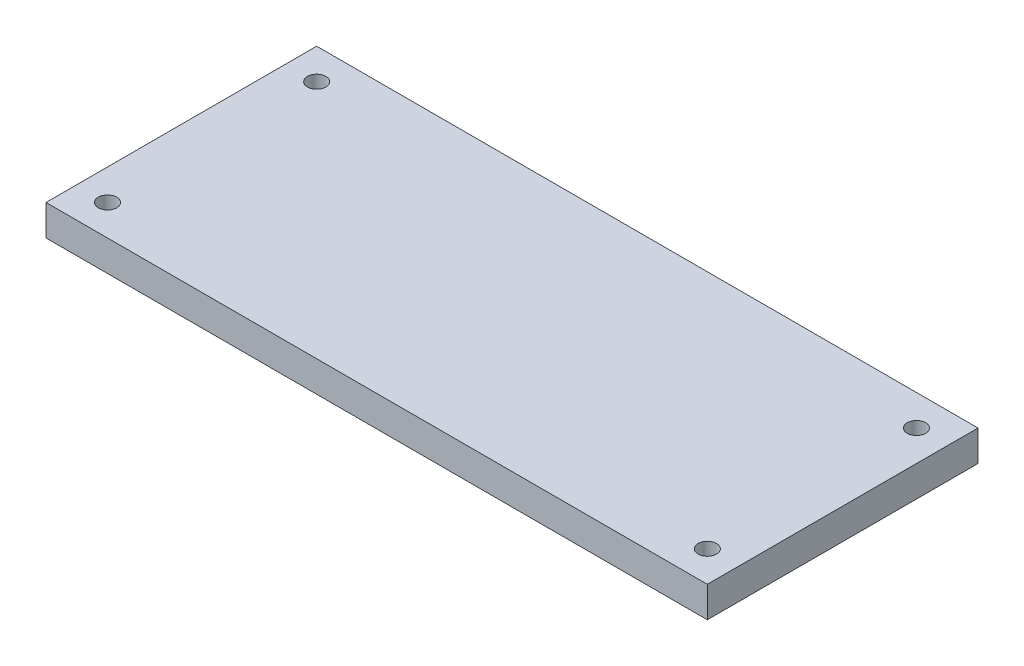
ISO-10303-21;
HEADER;
FILE_DESCRIPTION(('STEP AP214'),'2;1');
FILE_NAME('part.step','',(''),(''),'','','');
FILE_SCHEMA(('AUTOMOTIVE_DESIGN { 1 0 10303 214 1 1 1 1 }'));
ENDSEC;
DATA;
#1=APPLICATION_CONTEXT('core data for automotive mechanical design processes');
#2=APPLICATION_PROTOCOL_DEFINITION('international standard','automotive_design',2000,#1);
#3=PRODUCT_CONTEXT('',#1,'mechanical');
#4=PRODUCT('Part','Part','',(#3));
#5=PRODUCT_RELATED_PRODUCT_CATEGORY('part','',(#4));
#6=PRODUCT_DEFINITION_FORMATION('','',#4);
#7=PRODUCT_DEFINITION_CONTEXT('part definition',#1,'design');
#8=PRODUCT_DEFINITION('design','',#6,#7);
#9=PRODUCT_DEFINITION_SHAPE('','',#8);
#10=(LENGTH_UNIT() NAMED_UNIT(*) SI_UNIT(.MILLI.,.METRE.));
#11=(NAMED_UNIT(*) PLANE_ANGLE_UNIT() SI_UNIT($,.RADIAN.));
#12=(NAMED_UNIT(*) SI_UNIT($,.STERADIAN.) SOLID_ANGLE_UNIT());
#13=UNCERTAINTY_MEASURE_WITH_UNIT(LENGTH_MEASURE(1.E-05),#10,'distance_accuracy_value','');
#14=(GEOMETRIC_REPRESENTATION_CONTEXT(3) GLOBAL_UNCERTAINTY_ASSIGNED_CONTEXT((#13)) GLOBAL_UNIT_ASSIGNED_CONTEXT((#10,
#11,#12)) REPRESENTATION_CONTEXT('',''));
#15=CARTESIAN_POINT('',(0.,0.,0.));
#16=DIRECTION('',(0.,0.,1.));
#17=DIRECTION('',(1.,0.,0.));
#18=AXIS2_PLACEMENT_3D('',#15,#16,#17);
#19=CARTESIAN_POINT('',(0.,10.,0.));
#20=DIRECTION('',(0.,1.,0.));
#21=DIRECTION('',(0.,0.,1.));
#22=AXIS2_PLACEMENT_3D('',#19,#20,#21);
#23=PLANE('',#22);
#24=CARTESIAN_POINT('',(205.,10.,-78.));
#25=DIRECTION('',(0.,1.,0.));
#26=DIRECTION('',(0.,0.,1.));
#27=AXIS2_PLACEMENT_3D('',#24,#25,#26);
#28=CIRCLE('',#27,2.99999999999999);
#29=CARTESIAN_POINT('',(205.,10.,-75.));
#30=VERTEX_POINT('',#29);
#31=EDGE_CURVE('E142',#30,#30,#28,.T.);
#32=ORIENTED_EDGE('',*,*,#31,.F.);
#33=EDGE_LOOP('',(#32));
#34=FACE_BOUND('',#33,.T.);
#35=CARTESIAN_POINT('',(10.,10.,-10.));
#36=DIRECTION('',(0.,1.,0.));
#37=DIRECTION('',(0.,0.,1.));
#38=AXIS2_PLACEMENT_3D('',#35,#36,#37);
#39=CIRCLE('',#38,3.);
#40=CARTESIAN_POINT('',(10.,10.,-7.));
#41=VERTEX_POINT('',#40);
#42=EDGE_CURVE('E112',#41,#41,#39,.T.);
#43=ORIENTED_EDGE('',*,*,#42,.F.);
#44=EDGE_LOOP('',(#43));
#45=FACE_BOUND('',#44,.T.);
#46=DIRECTION('',(0.,0.,1.));
#47=VECTOR('',#46,1.);
#48=CARTESIAN_POINT('',(0.,10.,-88.));
#49=LINE('',#48,#47);
#50=CARTESIAN_POINT('',(0.,10.,-88.));
#51=VERTEX_POINT('',#50);
#52=CARTESIAN_POINT('',(0.,10.,0.));
#53=VERTEX_POINT('',#52);
#54=EDGE_CURVE('E92',#51,#53,#49,.T.);
#55=ORIENTED_EDGE('',*,*,#54,.T.);
#56=DIRECTION('',(1.,0.,0.));
#57=VECTOR('',#56,1.);
#58=CARTESIAN_POINT('',(0.,10.,0.));
#59=LINE('',#58,#57);
#60=CARTESIAN_POINT('',(215.,10.,0.));
#61=VERTEX_POINT('',#60);
#62=EDGE_CURVE('E87',#53,#61,#59,.T.);
#63=ORIENTED_EDGE('',*,*,#62,.T.);
#64=DIRECTION('',(0.,0.,-1.));
#65=VECTOR('',#64,1.);
#66=CARTESIAN_POINT('',(215.,10.,-88.));
#67=LINE('',#66,#65);
#68=CARTESIAN_POINT('',(215.,10.,-88.));
#69=VERTEX_POINT('',#68);
#70=EDGE_CURVE('E90',#61,#69,#67,.T.);
#71=ORIENTED_EDGE('',*,*,#70,.T.);
#72=DIRECTION('',(-1.,0.,0.));
#73=VECTOR('',#72,1.);
#74=CARTESIAN_POINT('',(0.,10.,-88.));
#75=LINE('',#74,#73);
#76=EDGE_CURVE('E57',#69,#51,#75,.T.);
#77=ORIENTED_EDGE('',*,*,#76,.T.);
#78=EDGE_LOOP('',(#55,#63,#71,#77));
#79=FACE_BOUND('',#78,.T.);
#80=CARTESIAN_POINT('',(10.,10.,-78.));
#81=DIRECTION('',(0.,1.,0.));
#82=DIRECTION('',(0.,0.,1.));
#83=AXIS2_PLACEMENT_3D('',#80,#81,#82);
#84=CIRCLE('',#83,3.);
#85=CARTESIAN_POINT('',(10.,10.,-75.));
#86=VERTEX_POINT('',#85);
#87=EDGE_CURVE('E134',#86,#86,#84,.T.);
#88=ORIENTED_EDGE('',*,*,#87,.F.);
#89=EDGE_LOOP('',(#88));
#90=FACE_BOUND('',#89,.T.);
#91=CARTESIAN_POINT('',(205.,10.,-10.));
#92=DIRECTION('',(0.,1.,0.));
#93=DIRECTION('',(0.,0.,1.));
#94=AXIS2_PLACEMENT_3D('',#91,#92,#93);
#95=CIRCLE('',#94,2.99999999999999);
#96=CARTESIAN_POINT('',(205.,10.,-7.00000000000001));
#97=VERTEX_POINT('',#96);
#98=EDGE_CURVE('E150',#97,#97,#95,.T.);
#99=ORIENTED_EDGE('',*,*,#98,.F.);
#100=EDGE_LOOP('',(#99));
#101=FACE_BOUND('',#100,.T.);
#102=ADVANCED_FACE('F39',(#34,#45,#79,#90,#101),#23,.T.);
#103=CARTESIAN_POINT('',(0.,0.,0.));
#104=DIRECTION('',(0.,1.,0.));
#105=DIRECTION('',(0.,0.,1.));
#106=AXIS2_PLACEMENT_3D('',#103,#104,#105);
#107=PLANE('',#106);
#108=DIRECTION('',(0.,0.,1.));
#109=VECTOR('',#108,1.);
#110=CARTESIAN_POINT('',(0.,0.,-88.));
#111=LINE('',#110,#109);
#112=CARTESIAN_POINT('',(0.,0.,-88.));
#113=VERTEX_POINT('',#112);
#114=CARTESIAN_POINT('',(0.,0.,0.));
#115=VERTEX_POINT('',#114);
#116=EDGE_CURVE('E108',#113,#115,#111,.T.);
#117=ORIENTED_EDGE('',*,*,#116,.F.);
#118=DIRECTION('',(-1.,0.,0.));
#119=VECTOR('',#118,1.);
#120=CARTESIAN_POINT('',(0.,0.,-88.));
#121=LINE('',#120,#119);
#122=CARTESIAN_POINT('',(215.,0.,-88.));
#123=VERTEX_POINT('',#122);
#124=EDGE_CURVE('E80',#123,#113,#121,.T.);
#125=ORIENTED_EDGE('',*,*,#124,.F.);
#126=DIRECTION('',(0.,0.,-1.));
#127=VECTOR('',#126,1.);
#128=CARTESIAN_POINT('',(215.,0.,-88.));
#129=LINE('',#128,#127);
#130=CARTESIAN_POINT('',(215.,0.,0.));
#131=VERTEX_POINT('',#130);
#132=EDGE_CURVE('E74',#131,#123,#129,.T.);
#133=ORIENTED_EDGE('',*,*,#132,.F.);
#134=DIRECTION('',(1.,0.,0.));
#135=VECTOR('',#134,1.);
#136=CARTESIAN_POINT('',(0.,0.,0.));
#137=LINE('',#136,#135);
#138=EDGE_CURVE('E97',#115,#131,#137,.T.);
#139=ORIENTED_EDGE('',*,*,#138,.F.);
#140=EDGE_LOOP('',(#117,#125,#133,#139));
#141=FACE_BOUND('',#140,.T.);
#142=CARTESIAN_POINT('',(10.,0.,-10.));
#143=DIRECTION('',(0.,1.,0.));
#144=DIRECTION('',(0.,0.,1.));
#145=AXIS2_PLACEMENT_3D('',#142,#143,#144);
#146=CIRCLE('',#145,3.);
#147=CARTESIAN_POINT('',(10.,0.,-7.));
#148=VERTEX_POINT('',#147);
#149=EDGE_CURVE('E130',#148,#148,#146,.T.);
#150=ORIENTED_EDGE('',*,*,#149,.T.);
#151=EDGE_LOOP('',(#150));
#152=FACE_BOUND('',#151,.T.);
#153=CARTESIAN_POINT('',(10.,0.,-78.));
#154=DIRECTION('',(0.,1.,0.));
#155=DIRECTION('',(0.,0.,1.));
#156=AXIS2_PLACEMENT_3D('',#153,#154,#155);
#157=CIRCLE('',#156,3.);
#158=CARTESIAN_POINT('',(10.,0.,-75.));
#159=VERTEX_POINT('',#158);
#160=EDGE_CURVE('E138',#159,#159,#157,.T.);
#161=ORIENTED_EDGE('',*,*,#160,.T.);
#162=EDGE_LOOP('',(#161));
#163=FACE_BOUND('',#162,.T.);
#164=CARTESIAN_POINT('',(205.,0.,-78.));
#165=DIRECTION('',(0.,1.,0.));
#166=DIRECTION('',(0.,0.,1.));
#167=AXIS2_PLACEMENT_3D('',#164,#165,#166);
#168=CIRCLE('',#167,2.99999999999999);
#169=CARTESIAN_POINT('',(205.,0.,-75.));
#170=VERTEX_POINT('',#169);
#171=EDGE_CURVE('E146',#170,#170,#168,.T.);
#172=ORIENTED_EDGE('',*,*,#171,.T.);
#173=EDGE_LOOP('',(#172));
#174=FACE_BOUND('',#173,.T.);
#175=CARTESIAN_POINT('',(205.,0.,-10.));
#176=DIRECTION('',(0.,1.,0.));
#177=DIRECTION('',(0.,0.,1.));
#178=AXIS2_PLACEMENT_3D('',#175,#176,#177);
#179=CIRCLE('',#178,2.99999999999999);
#180=CARTESIAN_POINT('',(205.,0.,-7.00000000000001));
#181=VERTEX_POINT('',#180);
#182=EDGE_CURVE('E154',#181,#181,#179,.T.);
#183=ORIENTED_EDGE('',*,*,#182,.T.);
#184=EDGE_LOOP('',(#183));
#185=FACE_BOUND('',#184,.T.);
#186=ADVANCED_FACE('F125',(#141,#152,#163,#174,#185),#107,.F.);
#187=CARTESIAN_POINT('',(0.,10.,-88.));
#188=DIRECTION('',(1.,0.,0.));
#189=DIRECTION('',(0.,0.,-1.));
#190=AXIS2_PLACEMENT_3D('',#187,#188,#189);
#191=PLANE('',#190);
#192=ORIENTED_EDGE('',*,*,#116,.T.);
#193=DIRECTION('',(0.,-1.,0.));
#194=VECTOR('',#193,1.);
#195=CARTESIAN_POINT('',(0.,10.,0.));
#196=LINE('',#195,#194);
#197=EDGE_CURVE('E11',#53,#115,#196,.T.);
#198=ORIENTED_EDGE('',*,*,#197,.F.);
#199=ORIENTED_EDGE('',*,*,#54,.F.);
#200=DIRECTION('',(0.,-1.,0.));
#201=VECTOR('',#200,1.);
#202=CARTESIAN_POINT('',(0.,10.,-88.));
#203=LINE('',#202,#201);
#204=EDGE_CURVE('E104',#51,#113,#203,.T.);
#205=ORIENTED_EDGE('',*,*,#204,.T.);
#206=EDGE_LOOP('',(#192,#198,#199,#205));
#207=FACE_BOUND('',#206,.T.);
#208=ADVANCED_FACE('F41',(#207),#191,.F.);
#209=CARTESIAN_POINT('',(0.,10.,0.));
#210=DIRECTION('',(0.,0.,-1.));
#211=DIRECTION('',(-1.,0.,0.));
#212=AXIS2_PLACEMENT_3D('',#209,#210,#211);
#213=PLANE('',#212);
#214=ORIENTED_EDGE('',*,*,#138,.T.);
#215=DIRECTION('',(0.,-1.,0.));
#216=VECTOR('',#215,1.);
#217=CARTESIAN_POINT('',(215.,10.,0.));
#218=LINE('',#217,#216);
#219=EDGE_CURVE('E49',#61,#131,#218,.T.);
#220=ORIENTED_EDGE('',*,*,#219,.F.);
#221=ORIENTED_EDGE('',*,*,#62,.F.);
#222=ORIENTED_EDGE('',*,*,#197,.T.);
#223=EDGE_LOOP('',(#214,#220,#221,#222));
#224=FACE_BOUND('',#223,.T.);
#225=ADVANCED_FACE('F96',(#224),#213,.F.);
#226=CARTESIAN_POINT('',(215.,10.,-88.));
#227=DIRECTION('',(-1.,0.,0.));
#228=DIRECTION('',(0.,0.,1.));
#229=AXIS2_PLACEMENT_3D('',#226,#227,#228);
#230=PLANE('',#229);
#231=ORIENTED_EDGE('',*,*,#132,.T.);
#232=DIRECTION('',(0.,-1.,0.));
#233=VECTOR('',#232,1.);
#234=CARTESIAN_POINT('',(215.,10.,-88.));
#235=LINE('',#234,#233);
#236=EDGE_CURVE('E99',#69,#123,#235,.T.);
#237=ORIENTED_EDGE('',*,*,#236,.F.);
#238=ORIENTED_EDGE('',*,*,#70,.F.);
#239=ORIENTED_EDGE('',*,*,#219,.T.);
#240=EDGE_LOOP('',(#231,#237,#238,#239));
#241=FACE_BOUND('',#240,.T.);
#242=ADVANCED_FACE('F100',(#241),#230,.F.);
#243=CARTESIAN_POINT('',(0.,10.,-88.));
#244=DIRECTION('',(0.,0.,1.));
#245=DIRECTION('',(1.,0.,0.));
#246=AXIS2_PLACEMENT_3D('',#243,#244,#245);
#247=PLANE('',#246);
#248=ORIENTED_EDGE('',*,*,#124,.T.);
#249=ORIENTED_EDGE('',*,*,#204,.F.);
#250=ORIENTED_EDGE('',*,*,#76,.F.);
#251=ORIENTED_EDGE('',*,*,#236,.T.);
#252=EDGE_LOOP('',(#248,#249,#250,#251));
#253=FACE_BOUND('',#252,.T.);
#254=ADVANCED_FACE('F122',(#253),#247,.F.);
#255=CARTESIAN_POINT('',(10.,10.,-10.));
#256=DIRECTION('',(0.,-1.,0.));
#257=DIRECTION('',(0.,0.,-1.));
#258=AXIS2_PLACEMENT_3D('',#255,#256,#257);
#259=CYLINDRICAL_SURFACE('',#258,3.);
#260=ORIENTED_EDGE('',*,*,#42,.T.);
#261=EDGE_LOOP('',(#260));
#262=FACE_BOUND('',#261,.T.);
#263=ORIENTED_EDGE('',*,*,#149,.F.);
#264=EDGE_LOOP('',(#263));
#265=FACE_BOUND('',#264,.T.);
#266=ADVANCED_FACE('F175',(#262,#265),#259,.F.);
#267=CARTESIAN_POINT('',(10.,10.,-78.));
#268=DIRECTION('',(0.,-1.,0.));
#269=DIRECTION('',(0.,0.,-1.));
#270=AXIS2_PLACEMENT_3D('',#267,#268,#269);
#271=CYLINDRICAL_SURFACE('',#270,3.);
#272=ORIENTED_EDGE('',*,*,#87,.T.);
#273=EDGE_LOOP('',(#272));
#274=FACE_BOUND('',#273,.T.);
#275=ORIENTED_EDGE('',*,*,#160,.F.);
#276=EDGE_LOOP('',(#275));
#277=FACE_BOUND('',#276,.T.);
#278=ADVANCED_FACE('F221',(#274,#277),#271,.F.);
#279=CARTESIAN_POINT('',(205.,10.,-78.));
#280=DIRECTION('',(0.,-1.,0.));
#281=DIRECTION('',(0.,0.,-1.));
#282=AXIS2_PLACEMENT_3D('',#279,#280,#281);
#283=CYLINDRICAL_SURFACE('',#282,2.99999999999999);
#284=ORIENTED_EDGE('',*,*,#31,.T.);
#285=EDGE_LOOP('',(#284));
#286=FACE_BOUND('',#285,.T.);
#287=ORIENTED_EDGE('',*,*,#171,.F.);
#288=EDGE_LOOP('',(#287));
#289=FACE_BOUND('',#288,.T.);
#290=ADVANCED_FACE('F229',(#286,#289),#283,.F.);
#291=CARTESIAN_POINT('',(205.,10.,-10.));
#292=DIRECTION('',(0.,-1.,0.));
#293=DIRECTION('',(0.,0.,-1.));
#294=AXIS2_PLACEMENT_3D('',#291,#292,#293);
#295=CYLINDRICAL_SURFACE('',#294,2.99999999999999);
#296=ORIENTED_EDGE('',*,*,#98,.T.);
#297=EDGE_LOOP('',(#296));
#298=FACE_BOUND('',#297,.T.);
#299=ORIENTED_EDGE('',*,*,#182,.F.);
#300=EDGE_LOOP('',(#299));
#301=FACE_BOUND('',#300,.T.);
#302=ADVANCED_FACE('F162',(#298,#301),#295,.F.);
#303=CLOSED_SHELL('',(#102,#186,#208,#225,#242,#254,#266,#278,#290,#302));
#304=MANIFOLD_SOLID_BREP('B2',#303);
#305=ADVANCED_BREP_SHAPE_REPRESENTATION('',(#18,#304),#14);
#306=SHAPE_DEFINITION_REPRESENTATION(#9,#305);
ENDSEC;
END-ISO-10303-21;
